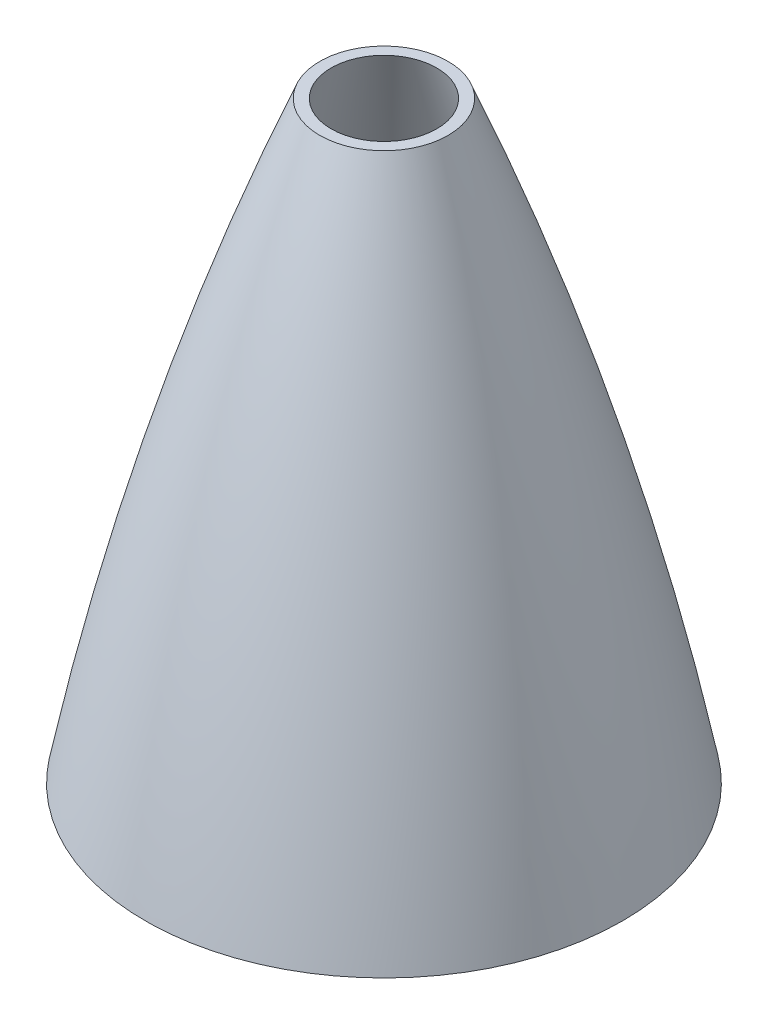
ISO-10303-21;
HEADER;
FILE_DESCRIPTION(('STEP AP214'),'2;1');
FILE_NAME('part.step','',(''),(''),'','','');
FILE_SCHEMA(('AUTOMOTIVE_DESIGN { 1 0 10303 214 1 1 1 1 }'));
ENDSEC;
DATA;
#1=APPLICATION_CONTEXT('core data for automotive mechanical design processes');
#2=APPLICATION_PROTOCOL_DEFINITION('international standard','automotive_design',2000,#1);
#3=PRODUCT_CONTEXT('',#1,'mechanical');
#4=PRODUCT('Part','Part','',(#3));
#5=PRODUCT_RELATED_PRODUCT_CATEGORY('part','',(#4));
#6=PRODUCT_DEFINITION_FORMATION('','',#4);
#7=PRODUCT_DEFINITION_CONTEXT('part definition',#1,'design');
#8=PRODUCT_DEFINITION('design','',#6,#7);
#9=PRODUCT_DEFINITION_SHAPE('','',#8);
#10=(LENGTH_UNIT() NAMED_UNIT(*) SI_UNIT(.MILLI.,.METRE.));
#11=(NAMED_UNIT(*) PLANE_ANGLE_UNIT() SI_UNIT($,.RADIAN.));
#12=(NAMED_UNIT(*) SI_UNIT($,.STERADIAN.) SOLID_ANGLE_UNIT());
#13=UNCERTAINTY_MEASURE_WITH_UNIT(LENGTH_MEASURE(1.E-05),#10,'distance_accuracy_value','');
#14=(GEOMETRIC_REPRESENTATION_CONTEXT(3) GLOBAL_UNCERTAINTY_ASSIGNED_CONTEXT((#13)) GLOBAL_UNIT_ASSIGNED_CONTEXT((#10,
#11,#12)) REPRESENTATION_CONTEXT('',''));
#15=CARTESIAN_POINT('',(0.,0.,0.));
#16=DIRECTION('',(0.,0.,1.));
#17=DIRECTION('',(1.,0.,0.));
#18=AXIS2_PLACEMENT_3D('',#15,#16,#17);
#19=CARTESIAN_POINT('',(-7.7715611723761E-13,-78.5092148022549,0.));
#20=DIRECTION('',(0.,1.,0.));
#21=DIRECTION('',(-1.,0.,0.));
#22=AXIS2_PLACEMENT_3D('',#19,#20,#21);
#23=DEGENERATE_TOROIDAL_SURFACE('',#22,992.11349278293,1093.36082838655,.F.);
#24=CARTESIAN_POINT('',(-7.7715611723761E-13,330.2,0.));
#25=DIRECTION('',(0.,1.,0.));
#26=DIRECTION('',(0.,0.,1.));
#27=AXIS2_PLACEMENT_3D('',#24,#25,#26);
#28=CIRCLE('',#27,21.9844703280578);
#29=CARTESIAN_POINT('',(-7.7715611723761E-13,330.2,21.9844703280578));
#30=VERTEX_POINT('',#29);
#31=EDGE_CURVE('E10',#30,#30,#28,.F.);
#32=ORIENTED_EDGE('',*,*,#31,.T.);
#33=EDGE_LOOP('',(#32));
#34=FACE_BOUND('',#33,.T.);
#35=CARTESIAN_POINT('',(-4.24833429484131E-13,126.9860046,0.));
#36=DIRECTION('',(0.,-1.,0.));
#37=DIRECTION('',(1.,0.,0.));
#38=AXIS2_PLACEMENT_3D('',#35,#36,#37);
#39=CIRCLE('',#38,81.7624850901899);
#40=CARTESIAN_POINT('',(81.7624850901895,126.9860046,0.));
#41=VERTEX_POINT('',#40);
#42=EDGE_CURVE('E52',#41,#41,#39,.F.);
#43=ORIENTED_EDGE('',*,*,#42,.T.);
#44=EDGE_LOOP('',(#43));
#45=FACE_BOUND('',#44,.T.);
#46=ADVANCED_FACE('F38',(#34,#45),#23,.F.);
#47=CARTESIAN_POINT('',(-8.88178419700125E-13,-90.9690996932709,0.));
#48=DIRECTION('',(0.,1.,0.));
#49=DIRECTION('',(-1.,0.,0.));
#50=AXIS2_PLACEMENT_3D('',#47,#48,#49);
#51=DEGENERATE_TOROIDAL_SURFACE('',#50,1112.69102888091,1206.67591223346,.F.);
#52=CARTESIAN_POINT('',(-8.88178419700125E-13,330.2,0.));
#53=DIRECTION('',(0.,1.,0.));
#54=DIRECTION('',(0.,0.,1.));
#55=AXIS2_PLACEMENT_3D('',#52,#53,#54);
#56=CIRCLE('',#55,18.0977872240295);
#57=CARTESIAN_POINT('',(-8.88178419700125E-13,330.2,18.0977872240295));
#58=VERTEX_POINT('',#57);
#59=EDGE_CURVE('E46',#58,#58,#56,.T.);
#60=ORIENTED_EDGE('',*,*,#59,.T.);
#61=EDGE_LOOP('',(#60));
#62=FACE_BOUND('',#61,.T.);
#63=CARTESIAN_POINT('',(-5.14493190537309E-13,126.9860046,0.));
#64=DIRECTION('',(0.,-1.,0.));
#65=DIRECTION('',(1.,0.,0.));
#66=AXIS2_PLACEMENT_3D('',#63,#64,#65);
#67=CIRCLE('',#66,74.1376570198651);
#68=CARTESIAN_POINT('',(74.1376570198646,126.9860046,0.));
#69=VERTEX_POINT('',#68);
#70=EDGE_CURVE('E41',#69,#69,#67,.T.);
#71=ORIENTED_EDGE('',*,*,#70,.T.);
#72=EDGE_LOOP('',(#71));
#73=FACE_BOUND('',#72,.T.);
#74=ADVANCED_FACE('F62',(#62,#73),#51,.T.);
#75=CARTESIAN_POINT('',(0.,330.2,0.));
#76=DIRECTION('',(0.,1.,0.));
#77=DIRECTION('',(0.,0.,1.));
#78=AXIS2_PLACEMENT_3D('',#75,#76,#77);
#79=PLANE('',#78);
#80=ORIENTED_EDGE('',*,*,#31,.F.);
#81=EDGE_LOOP('',(#80));
#82=FACE_BOUND('',#81,.T.);
#83=ORIENTED_EDGE('',*,*,#59,.F.);
#84=EDGE_LOOP('',(#83));
#85=FACE_BOUND('',#84,.T.);
#86=ADVANCED_FACE('F66',(#82,#85),#79,.T.);
#87=CARTESIAN_POINT('',(2.17718205697863E-13,126.9860046,0.));
#88=DIRECTION('',(0.,-1.,0.));
#89=DIRECTION('',(1.,0.,0.));
#90=AXIS2_PLACEMENT_3D('',#87,#88,#89);
#91=PLANE('',#90);
#92=ORIENTED_EDGE('',*,*,#42,.F.);
#93=EDGE_LOOP('',(#92));
#94=FACE_BOUND('',#93,.T.);
#95=ORIENTED_EDGE('',*,*,#70,.F.);
#96=EDGE_LOOP('',(#95));
#97=FACE_BOUND('',#96,.T.);
#98=ADVANCED_FACE('F64',(#94,#97),#91,.T.);
#99=CLOSED_SHELL('',(#46,#74,#86,#98));
#100=MANIFOLD_SOLID_BREP('B2',#99);
#101=ADVANCED_BREP_SHAPE_REPRESENTATION('',(#18,#100),#14);
#102=SHAPE_DEFINITION_REPRESENTATION(#9,#101);
ENDSEC;
END-ISO-10303-21;
